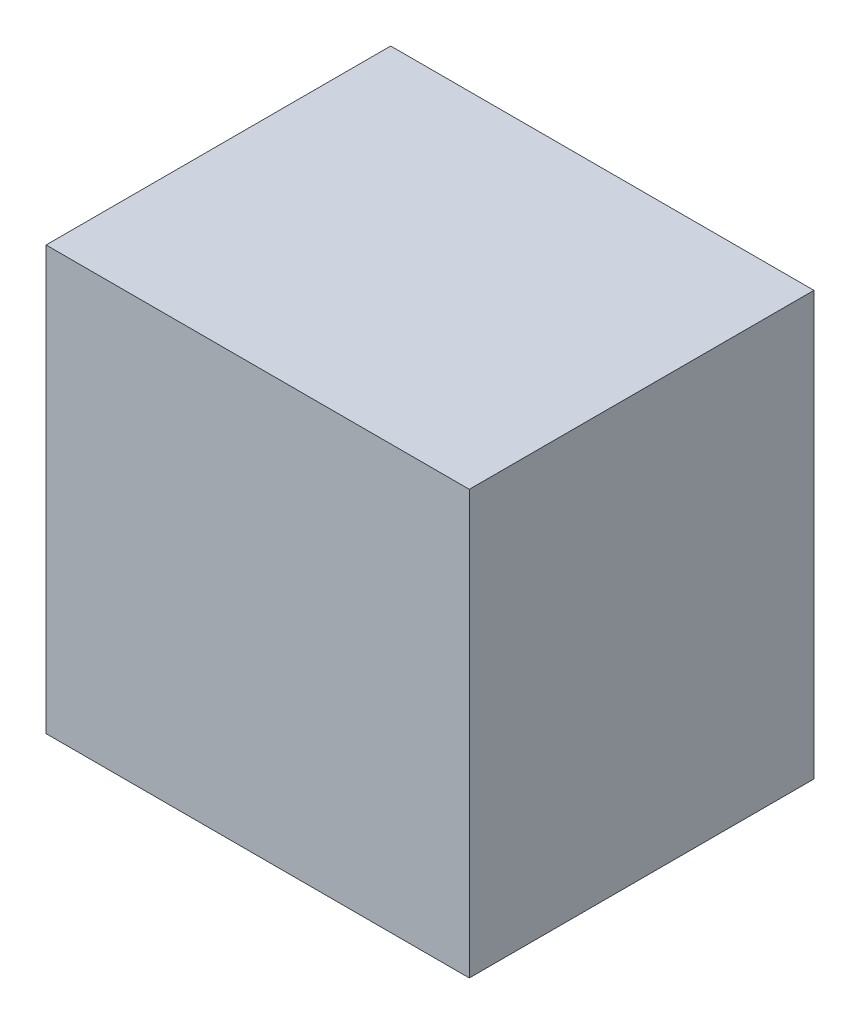
ISO-10303-21;
HEADER;
FILE_DESCRIPTION(('STEP AP214'),'2;1');
FILE_NAME('part.step','',(''),(''),'','','');
FILE_SCHEMA(('AUTOMOTIVE_DESIGN { 1 0 10303 214 1 1 1 1 }'));
ENDSEC;
DATA;
#1=APPLICATION_CONTEXT('core data for automotive mechanical design processes');
#2=APPLICATION_PROTOCOL_DEFINITION('international standard','automotive_design',2000,#1);
#3=PRODUCT_CONTEXT('',#1,'mechanical');
#4=PRODUCT('Part','Part','',(#3));
#5=PRODUCT_RELATED_PRODUCT_CATEGORY('part','',(#4));
#6=PRODUCT_DEFINITION_FORMATION('','',#4);
#7=PRODUCT_DEFINITION_CONTEXT('part definition',#1,'design');
#8=PRODUCT_DEFINITION('design','',#6,#7);
#9=PRODUCT_DEFINITION_SHAPE('','',#8);
#10=(LENGTH_UNIT() NAMED_UNIT(*) SI_UNIT(.MILLI.,.METRE.));
#11=(NAMED_UNIT(*) PLANE_ANGLE_UNIT() SI_UNIT($,.RADIAN.));
#12=(NAMED_UNIT(*) SI_UNIT($,.STERADIAN.) SOLID_ANGLE_UNIT());
#13=UNCERTAINTY_MEASURE_WITH_UNIT(LENGTH_MEASURE(1.E-05),#10,'distance_accuracy_value','');
#14=(GEOMETRIC_REPRESENTATION_CONTEXT(3) GLOBAL_UNCERTAINTY_ASSIGNED_CONTEXT((#13)) GLOBAL_UNIT_ASSIGNED_CONTEXT((#10,
#11,#12)) REPRESENTATION_CONTEXT('',''));
#15=CARTESIAN_POINT('',(0.,0.,0.));
#16=DIRECTION('',(0.,0.,1.));
#17=DIRECTION('',(1.,0.,0.));
#18=AXIS2_PLACEMENT_3D('',#15,#16,#17);
#19=CARTESIAN_POINT('',(19.25,223.25,28.5));
#20=DIRECTION('',(-1.,0.,0.));
#21=DIRECTION('',(0.,-1.,0.));
#22=AXIS2_PLACEMENT_3D('',#19,#20,#21);
#23=PLANE('',#22);
#24=DIRECTION('',(0.,1.,0.));
#25=VECTOR('',#24,1.);
#26=CARTESIAN_POINT('',(19.25,223.25,0.));
#27=LINE('',#26,#25);
#28=CARTESIAN_POINT('',(19.25,188.25,0.));
#29=VERTEX_POINT('',#28);
#30=CARTESIAN_POINT('',(19.25,223.25,0.));
#31=VERTEX_POINT('',#30);
#32=EDGE_CURVE('E104',#29,#31,#27,.T.);
#33=ORIENTED_EDGE('',*,*,#32,.T.);
#34=DIRECTION('',(0.,0.,-1.));
#35=VECTOR('',#34,1.);
#36=CARTESIAN_POINT('',(19.25,223.25,28.5));
#37=LINE('',#36,#35);
#38=CARTESIAN_POINT('',(19.25,223.25,28.5));
#39=VERTEX_POINT('',#38);
#40=EDGE_CURVE('E11',#39,#31,#37,.T.);
#41=ORIENTED_EDGE('',*,*,#40,.F.);
#42=DIRECTION('',(0.,1.,0.));
#43=VECTOR('',#42,1.);
#44=CARTESIAN_POINT('',(19.25,223.25,28.5));
#45=LINE('',#44,#43);
#46=CARTESIAN_POINT('',(19.25,188.25,28.5));
#47=VERTEX_POINT('',#46);
#48=EDGE_CURVE('E113',#47,#39,#45,.T.);
#49=ORIENTED_EDGE('',*,*,#48,.F.);
#50=DIRECTION('',(0.,0.,-1.));
#51=VECTOR('',#50,1.);
#52=CARTESIAN_POINT('',(19.25,188.25,28.5));
#53=LINE('',#52,#51);
#54=EDGE_CURVE('E118',#47,#29,#53,.T.);
#55=ORIENTED_EDGE('',*,*,#54,.T.);
#56=EDGE_LOOP('',(#33,#41,#49,#55));
#57=FACE_BOUND('',#56,.T.);
#58=ADVANCED_FACE('F43',(#57),#23,.F.);
#59=CARTESIAN_POINT('',(-15.75,223.25,28.5));
#60=DIRECTION('',(0.,-1.,0.));
#61=DIRECTION('',(0.,0.,-1.));
#62=AXIS2_PLACEMENT_3D('',#59,#60,#61);
#63=PLANE('',#62);
#64=DIRECTION('',(-1.,0.,0.));
#65=VECTOR('',#64,1.);
#66=CARTESIAN_POINT('',(-15.75,223.25,0.));
#67=LINE('',#66,#65);
#68=CARTESIAN_POINT('',(-15.75,223.25,0.));
#69=VERTEX_POINT('',#68);
#70=EDGE_CURVE('E108',#31,#69,#67,.T.);
#71=ORIENTED_EDGE('',*,*,#70,.T.);
#72=DIRECTION('',(0.,0.,-1.));
#73=VECTOR('',#72,1.);
#74=CARTESIAN_POINT('',(-15.75,223.25,28.5));
#75=LINE('',#74,#73);
#76=CARTESIAN_POINT('',(-15.75,223.25,28.5));
#77=VERTEX_POINT('',#76);
#78=EDGE_CURVE('E51',#77,#69,#75,.T.);
#79=ORIENTED_EDGE('',*,*,#78,.F.);
#80=DIRECTION('',(-1.,0.,0.));
#81=VECTOR('',#80,1.);
#82=CARTESIAN_POINT('',(-15.75,223.25,28.5));
#83=LINE('',#82,#81);
#84=EDGE_CURVE('E90',#39,#77,#83,.T.);
#85=ORIENTED_EDGE('',*,*,#84,.F.);
#86=ORIENTED_EDGE('',*,*,#40,.T.);
#87=EDGE_LOOP('',(#71,#79,#85,#86));
#88=FACE_BOUND('',#87,.T.);
#89=ADVANCED_FACE('F141',(#88),#63,.F.);
#90=CARTESIAN_POINT('',(-15.75,223.25,28.5));
#91=DIRECTION('',(1.,0.,0.));
#92=DIRECTION('',(0.,1.,0.));
#93=AXIS2_PLACEMENT_3D('',#90,#91,#92);
#94=PLANE('',#93);
#95=DIRECTION('',(0.,-1.,0.));
#96=VECTOR('',#95,1.);
#97=CARTESIAN_POINT('',(-15.75,223.25,0.));
#98=LINE('',#97,#96);
#99=CARTESIAN_POINT('',(-15.75,188.25,0.));
#100=VERTEX_POINT('',#99);
#101=EDGE_CURVE('E77',#69,#100,#98,.T.);
#102=ORIENTED_EDGE('',*,*,#101,.T.);
#103=DIRECTION('',(0.,0.,-1.));
#104=VECTOR('',#103,1.);
#105=CARTESIAN_POINT('',(-15.75,188.25,28.5));
#106=LINE('',#105,#104);
#107=CARTESIAN_POINT('',(-15.75,188.25,28.5));
#108=VERTEX_POINT('',#107);
#109=EDGE_CURVE('E124',#108,#100,#106,.T.);
#110=ORIENTED_EDGE('',*,*,#109,.F.);
#111=DIRECTION('',(0.,-1.,0.));
#112=VECTOR('',#111,1.);
#113=CARTESIAN_POINT('',(-15.75,223.25,28.5));
#114=LINE('',#113,#112);
#115=EDGE_CURVE('E116',#77,#108,#114,.T.);
#116=ORIENTED_EDGE('',*,*,#115,.F.);
#117=ORIENTED_EDGE('',*,*,#78,.T.);
#118=EDGE_LOOP('',(#102,#110,#116,#117));
#119=FACE_BOUND('',#118,.T.);
#120=ADVANCED_FACE('F126',(#119),#94,.F.);
#121=CARTESIAN_POINT('',(-15.75,188.25,28.5));
#122=DIRECTION('',(0.,1.,0.));
#123=DIRECTION('',(0.,0.,1.));
#124=AXIS2_PLACEMENT_3D('',#121,#122,#123);
#125=PLANE('',#124);
#126=DIRECTION('',(1.,0.,0.));
#127=VECTOR('',#126,1.);
#128=CARTESIAN_POINT('',(-15.75,188.25,0.));
#129=LINE('',#128,#127);
#130=EDGE_CURVE('E83',#100,#29,#129,.T.);
#131=ORIENTED_EDGE('',*,*,#130,.T.);
#132=ORIENTED_EDGE('',*,*,#54,.F.);
#133=DIRECTION('',(1.,0.,0.));
#134=VECTOR('',#133,1.);
#135=CARTESIAN_POINT('',(-15.75,188.25,28.5));
#136=LINE('',#135,#134);
#137=EDGE_CURVE('E59',#108,#47,#136,.T.);
#138=ORIENTED_EDGE('',*,*,#137,.F.);
#139=ORIENTED_EDGE('',*,*,#109,.T.);
#140=EDGE_LOOP('',(#131,#132,#138,#139));
#141=FACE_BOUND('',#140,.T.);
#142=ADVANCED_FACE('F132',(#141),#125,.F.);
#143=CARTESIAN_POINT('',(0.,0.,28.5));
#144=DIRECTION('',(0.,0.,1.));
#145=DIRECTION('',(1.,0.,0.));
#146=AXIS2_PLACEMENT_3D('',#143,#144,#145);
#147=PLANE('',#146);
#148=ORIENTED_EDGE('',*,*,#48,.T.);
#149=ORIENTED_EDGE('',*,*,#84,.T.);
#150=ORIENTED_EDGE('',*,*,#115,.T.);
#151=ORIENTED_EDGE('',*,*,#137,.T.);
#152=EDGE_LOOP('',(#148,#149,#150,#151));
#153=FACE_BOUND('',#152,.T.);
#154=ADVANCED_FACE('F134',(#153),#147,.T.);
#155=CARTESIAN_POINT('',(0.,0.,0.));
#156=DIRECTION('',(0.,0.,1.));
#157=DIRECTION('',(1.,0.,0.));
#158=AXIS2_PLACEMENT_3D('',#155,#156,#157);
#159=PLANE('',#158);
#160=CARTESIAN_POINT('',(1.75000000000003,205.75,0.));
#161=DIRECTION('',(0.,0.,-1.));
#162=DIRECTION('',(-1.,0.,0.));
#163=AXIS2_PLACEMENT_3D('',#160,#161,#162);
#164=CIRCLE('',#163,2.49999999999999);
#165=CARTESIAN_POINT('',(-0.749999999999961,205.75,0.));
#166=VERTEX_POINT('',#165);
#167=EDGE_CURVE('E105',#166,#166,#164,.T.);
#168=ORIENTED_EDGE('',*,*,#167,.F.);
#169=EDGE_LOOP('',(#168));
#170=FACE_BOUND('',#169,.T.);
#171=ORIENTED_EDGE('',*,*,#32,.F.);
#172=ORIENTED_EDGE('',*,*,#130,.F.);
#173=ORIENTED_EDGE('',*,*,#101,.F.);
#174=ORIENTED_EDGE('',*,*,#70,.F.);
#175=EDGE_LOOP('',(#171,#172,#173,#174));
#176=FACE_BOUND('',#175,.T.);
#177=ADVANCED_FACE('F98',(#170,#176),#159,.F.);
#178=CARTESIAN_POINT('',(1.75000000000003,205.75,17.));
#179=DIRECTION('',(0.,0.,-1.));
#180=DIRECTION('',(-1.,0.,0.));
#181=AXIS2_PLACEMENT_3D('',#178,#179,#180);
#182=CONICAL_SURFACE('',#181,2.49999999999999,1.02974425867665);
#183=CARTESIAN_POINT('',(1.75000000000002,205.75,18.5021515475689));
#184=VERTEX_POINT('',#183);
#185=VERTEX_LOOP('',#184);
#186=FACE_BOUND('',#185,.T.);
#187=CARTESIAN_POINT('',(1.75000000000003,205.75,17.));
#188=DIRECTION('',(0.,0.,-1.));
#189=DIRECTION('',(-1.,0.,0.));
#190=AXIS2_PLACEMENT_3D('',#187,#188,#189);
#191=CIRCLE('',#190,2.49999999999999);
#192=CARTESIAN_POINT('',(-0.749999999999957,205.75,17.));
#193=VERTEX_POINT('',#192);
#194=EDGE_CURVE('E102',#193,#193,#191,.T.);
#195=ORIENTED_EDGE('',*,*,#194,.T.);
#196=EDGE_LOOP('',(#195));
#197=FACE_BOUND('',#196,.T.);
#198=ADVANCED_FACE('F94',(#186,#197),#182,.F.);
#199=CARTESIAN_POINT('',(1.75000000000003,205.75,0.));
#200=DIRECTION('',(0.,0.,-1.));
#201=DIRECTION('',(-1.,0.,0.));
#202=AXIS2_PLACEMENT_3D('',#199,#200,#201);
#203=CYLINDRICAL_SURFACE('',#202,2.49999999999999);
#204=ORIENTED_EDGE('',*,*,#194,.F.);
#205=EDGE_LOOP('',(#204));
#206=FACE_BOUND('',#205,.T.);
#207=ORIENTED_EDGE('',*,*,#167,.T.);
#208=EDGE_LOOP('',(#207));
#209=FACE_BOUND('',#208,.T.);
#210=ADVANCED_FACE('F97',(#206,#209),#203,.F.);
#211=CLOSED_SHELL('',(#58,#89,#120,#142,#154,#177,#198,#210));
#212=MANIFOLD_SOLID_BREP('B2',#211);
#213=ADVANCED_BREP_SHAPE_REPRESENTATION('',(#18,#212),#14);
#214=SHAPE_DEFINITION_REPRESENTATION(#9,#213);
ENDSEC;
END-ISO-10303-21;
